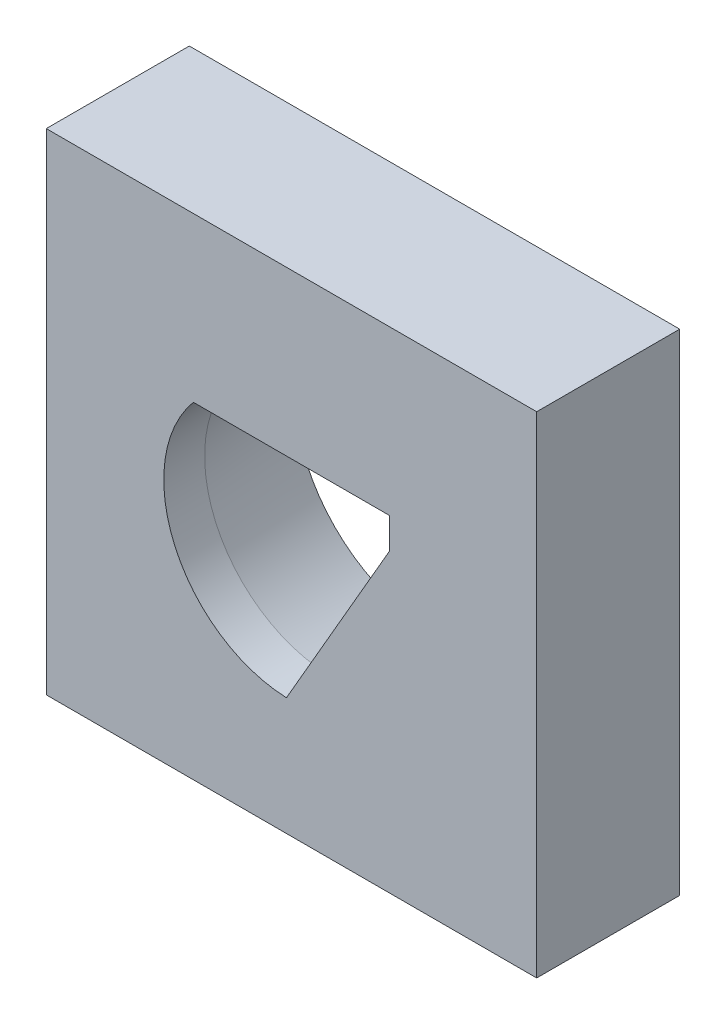
ISO-10303-21;
HEADER;
FILE_DESCRIPTION(('STEP AP214'),'2;1');
FILE_NAME('part.step','',(''),(''),'','','');
FILE_SCHEMA(('AUTOMOTIVE_DESIGN { 1 0 10303 214 1 1 1 1 }'));
ENDSEC;
DATA;
#1=APPLICATION_CONTEXT('core data for automotive mechanical design processes');
#2=APPLICATION_PROTOCOL_DEFINITION('international standard','automotive_design',2000,#1);
#3=PRODUCT_CONTEXT('',#1,'mechanical');
#4=PRODUCT('Part','Part','',(#3));
#5=PRODUCT_RELATED_PRODUCT_CATEGORY('part','',(#4));
#6=PRODUCT_DEFINITION_FORMATION('','',#4);
#7=PRODUCT_DEFINITION_CONTEXT('part definition',#1,'design');
#8=PRODUCT_DEFINITION('design','',#6,#7);
#9=PRODUCT_DEFINITION_SHAPE('','',#8);
#10=(LENGTH_UNIT() NAMED_UNIT(*) SI_UNIT(.MILLI.,.METRE.));
#11=(NAMED_UNIT(*) PLANE_ANGLE_UNIT() SI_UNIT($,.RADIAN.));
#12=(NAMED_UNIT(*) SI_UNIT($,.STERADIAN.) SOLID_ANGLE_UNIT());
#13=UNCERTAINTY_MEASURE_WITH_UNIT(LENGTH_MEASURE(1.E-05),#10,'distance_accuracy_value','');
#14=(GEOMETRIC_REPRESENTATION_CONTEXT(3) GLOBAL_UNCERTAINTY_ASSIGNED_CONTEXT((#13)) GLOBAL_UNIT_ASSIGNED_CONTEXT((#10,
#11,#12)) REPRESENTATION_CONTEXT('',''));
#15=CARTESIAN_POINT('',(0.,0.,0.));
#16=DIRECTION('',(0.,0.,1.));
#17=DIRECTION('',(1.,0.,0.));
#18=AXIS2_PLACEMENT_3D('',#15,#16,#17);
#19=CARTESIAN_POINT('',(0.,0.,-5.));
#20=DIRECTION('',(0.,0.,1.));
#21=DIRECTION('',(1.,0.,0.));
#22=AXIS2_PLACEMENT_3D('',#19,#20,#21);
#23=PLANE('',#22);
#24=DIRECTION('',(0.,1.,0.));
#25=VECTOR('',#24,1.);
#26=CARTESIAN_POINT('',(24.,24.,-5.));
#27=LINE('',#26,#25);
#28=CARTESIAN_POINT('',(24.,-24.,-5.));
#29=VERTEX_POINT('',#28);
#30=CARTESIAN_POINT('',(24.,24.,-5.));
#31=VERTEX_POINT('',#30);
#32=EDGE_CURVE('E175',#29,#31,#27,.T.);
#33=ORIENTED_EDGE('',*,*,#32,.F.);
#34=DIRECTION('',(1.,0.,0.));
#35=VECTOR('',#34,1.);
#36=CARTESIAN_POINT('',(-24.,-24.,-5.));
#37=LINE('',#36,#35);
#38=CARTESIAN_POINT('',(-24.,-24.,-5.));
#39=VERTEX_POINT('',#38);
#40=EDGE_CURVE('E231',#39,#29,#37,.T.);
#41=ORIENTED_EDGE('',*,*,#40,.F.);
#42=DIRECTION('',(0.,-1.,0.));
#43=VECTOR('',#42,1.);
#44=CARTESIAN_POINT('',(-24.,24.,-5.));
#45=LINE('',#44,#43);
#46=CARTESIAN_POINT('',(-24.,24.,-5.));
#47=VERTEX_POINT('',#46);
#48=EDGE_CURVE('E222',#47,#39,#45,.T.);
#49=ORIENTED_EDGE('',*,*,#48,.F.);
#50=DIRECTION('',(-1.,0.,0.));
#51=VECTOR('',#50,1.);
#52=CARTESIAN_POINT('',(-24.,24.,-5.));
#53=LINE('',#52,#51);
#54=EDGE_CURVE('E215',#31,#47,#53,.T.);
#55=ORIENTED_EDGE('',*,*,#54,.F.);
#56=EDGE_LOOP('',(#33,#41,#49,#55));
#57=FACE_BOUND('',#56,.T.);
#58=CARTESIAN_POINT('',(0.,0.,-5.));
#59=DIRECTION('',(0.,0.,1.));
#60=DIRECTION('',(1.,0.,0.));
#61=AXIS2_PLACEMENT_3D('',#58,#59,#60);
#62=CIRCLE('',#61,13.7278456090291);
#63=CARTESIAN_POINT('',(0.210888914936279,-13.7262256622458,-5.));
#64=VERTEX_POINT('',#63);
#65=CARTESIAN_POINT('',(-10.1636907903222,9.22784560902811,-5.));
#66=VERTEX_POINT('',#65);
#67=EDGE_CURVE('E167',#64,#66,#62,.F.);
#68=ORIENTED_EDGE('',*,*,#67,.F.);
#69=DIRECTION('',(0.500000000000001,0.866025403784438,0.));
#70=VECTOR('',#69,1.);
#71=CARTESIAN_POINT('',(6.10179674699358,-3.52287399441714,-5.));
#72=LINE('',#71,#70);
#73=CARTESIAN_POINT('',(10.8325319651757,4.67099976062962,-5.));
#74=VERTEX_POINT('',#73);
#75=EDGE_CURVE('E261',#74,#64,#72,.F.);
#76=ORIENTED_EDGE('',*,*,#75,.F.);
#77=DIRECTION('',(0.,1.,0.));
#78=VECTOR('',#77,1.);
#79=CARTESIAN_POINT('',(10.8325319651757,0.,-5.));
#80=LINE('',#79,#78);
#81=CARTESIAN_POINT('',(10.8325319651757,9.22784560902811,-5.));
#82=VERTEX_POINT('',#81);
#83=EDGE_CURVE('E263',#82,#74,#80,.F.);
#84=ORIENTED_EDGE('',*,*,#83,.F.);
#85=DIRECTION('',(-1.,0.,0.));
#86=VECTOR('',#85,1.);
#87=CARTESIAN_POINT('',(0.,9.22784560902811,-5.));
#88=LINE('',#87,#86);
#89=EDGE_CURVE('E265',#66,#82,#88,.F.);
#90=ORIENTED_EDGE('',*,*,#89,.F.);
#91=EDGE_LOOP('',(#68,#76,#84,#90));
#92=FACE_BOUND('',#91,.T.);
#93=ADVANCED_FACE('F50',(#57,#92),#23,.F.);
#94=CARTESIAN_POINT('',(24.,24.,5.));
#95=DIRECTION('',(-1.,0.,0.));
#96=DIRECTION('',(0.,-1.,0.));
#97=AXIS2_PLACEMENT_3D('',#94,#95,#96);
#98=PLANE('',#97);
#99=ORIENTED_EDGE('',*,*,#32,.T.);
#100=DIRECTION('',(0.,0.,-1.));
#101=VECTOR('',#100,1.);
#102=CARTESIAN_POINT('',(24.,24.,5.));
#103=LINE('',#102,#101);
#104=CARTESIAN_POINT('',(24.,24.,9.));
#105=VERTEX_POINT('',#104);
#106=EDGE_CURVE('E13',#105,#31,#103,.T.);
#107=ORIENTED_EDGE('',*,*,#106,.F.);
#108=DIRECTION('',(0.,1.,0.));
#109=VECTOR('',#108,1.);
#110=CARTESIAN_POINT('',(24.,0.,9.));
#111=LINE('',#110,#109);
#112=CARTESIAN_POINT('',(24.,-24.,9.));
#113=VERTEX_POINT('',#112);
#114=EDGE_CURVE('E247',#113,#105,#111,.T.);
#115=ORIENTED_EDGE('',*,*,#114,.F.);
#116=DIRECTION('',(0.,0.,-1.));
#117=VECTOR('',#116,1.);
#118=CARTESIAN_POINT('',(24.,-24.,5.));
#119=LINE('',#118,#117);
#120=EDGE_CURVE('E233',#113,#29,#119,.T.);
#121=ORIENTED_EDGE('',*,*,#120,.T.);
#122=EDGE_LOOP('',(#99,#107,#115,#121));
#123=FACE_BOUND('',#122,.T.);
#124=ADVANCED_FACE('F52',(#123),#98,.F.);
#125=CARTESIAN_POINT('',(-24.,24.,5.));
#126=DIRECTION('',(0.,-1.,0.));
#127=DIRECTION('',(0.,0.,-1.));
#128=AXIS2_PLACEMENT_3D('',#125,#126,#127);
#129=PLANE('',#128);
#130=ORIENTED_EDGE('',*,*,#54,.T.);
#131=DIRECTION('',(0.,0.,-1.));
#132=VECTOR('',#131,1.);
#133=CARTESIAN_POINT('',(-24.,24.,5.));
#134=LINE('',#133,#132);
#135=CARTESIAN_POINT('',(-24.,24.,9.));
#136=VERTEX_POINT('',#135);
#137=EDGE_CURVE('E58',#136,#47,#134,.T.);
#138=ORIENTED_EDGE('',*,*,#137,.F.);
#139=DIRECTION('',(-1.,0.,0.));
#140=VECTOR('',#139,1.);
#141=CARTESIAN_POINT('',(0.,24.,9.));
#142=LINE('',#141,#140);
#143=EDGE_CURVE('E243',#105,#136,#142,.T.);
#144=ORIENTED_EDGE('',*,*,#143,.F.);
#145=ORIENTED_EDGE('',*,*,#106,.T.);
#146=EDGE_LOOP('',(#130,#138,#144,#145));
#147=FACE_BOUND('',#146,.T.);
#148=ADVANCED_FACE('F207',(#147),#129,.F.);
#149=CARTESIAN_POINT('',(-24.,24.,5.));
#150=DIRECTION('',(1.,0.,0.));
#151=DIRECTION('',(0.,1.,0.));
#152=AXIS2_PLACEMENT_3D('',#149,#150,#151);
#153=PLANE('',#152);
#154=ORIENTED_EDGE('',*,*,#48,.T.);
#155=DIRECTION('',(0.,0.,-1.));
#156=VECTOR('',#155,1.);
#157=CARTESIAN_POINT('',(-24.,-24.,5.));
#158=LINE('',#157,#156);
#159=CARTESIAN_POINT('',(-24.,-24.,9.));
#160=VERTEX_POINT('',#159);
#161=EDGE_CURVE('E228',#160,#39,#158,.T.);
#162=ORIENTED_EDGE('',*,*,#161,.F.);
#163=DIRECTION('',(0.,-1.,0.));
#164=VECTOR('',#163,1.);
#165=CARTESIAN_POINT('',(-24.,0.,9.));
#166=LINE('',#165,#164);
#167=EDGE_CURVE('E227',#136,#160,#166,.T.);
#168=ORIENTED_EDGE('',*,*,#167,.F.);
#169=ORIENTED_EDGE('',*,*,#137,.T.);
#170=EDGE_LOOP('',(#154,#162,#168,#169));
#171=FACE_BOUND('',#170,.T.);
#172=ADVANCED_FACE('F204',(#171),#153,.F.);
#173=CARTESIAN_POINT('',(-24.,-24.,5.));
#174=DIRECTION('',(0.,1.,0.));
#175=DIRECTION('',(0.,0.,1.));
#176=AXIS2_PLACEMENT_3D('',#173,#174,#175);
#177=PLANE('',#176);
#178=ORIENTED_EDGE('',*,*,#40,.T.);
#179=ORIENTED_EDGE('',*,*,#120,.F.);
#180=DIRECTION('',(1.,0.,0.));
#181=VECTOR('',#180,1.);
#182=CARTESIAN_POINT('',(0.,-24.,9.));
#183=LINE('',#182,#181);
#184=EDGE_CURVE('E241',#160,#113,#183,.T.);
#185=ORIENTED_EDGE('',*,*,#184,.F.);
#186=ORIENTED_EDGE('',*,*,#161,.T.);
#187=EDGE_LOOP('',(#178,#179,#185,#186));
#188=FACE_BOUND('',#187,.T.);
#189=ADVANCED_FACE('F189',(#188),#177,.F.);
#190=CARTESIAN_POINT('',(0.,0.,5.));
#191=DIRECTION('',(0.,0.,-1.));
#192=DIRECTION('',(1.,0.,0.));
#193=AXIS2_PLACEMENT_3D('',#190,#191,#192);
#194=CONICAL_SURFACE('',#193,12.5,0.122173047639603);
#195=CARTESIAN_POINT('',(0.,0.,5.));
#196=DIRECTION('',(0.,0.,1.));
#197=DIRECTION('',(1.,0.,0.));
#198=AXIS2_PLACEMENT_3D('',#195,#196,#197);
#199=CIRCLE('',#198,12.5);
#200=CARTESIAN_POINT('',(-0.493320879267116,-12.4902615869356,5.));
#201=VERTEX_POINT('',#200);
#202=CARTESIAN_POINT('',(-9.60468635615006,7.99999999999906,5.));
#203=VERTEX_POINT('',#202);
#204=EDGE_CURVE('E65',#201,#203,#199,.F.);
#205=ORIENTED_EDGE('',*,*,#204,.F.);
#206=CARTESIAN_POINT('',(0.210888914936279,-13.7262256622458,-5.));
#207=CARTESIAN_POINT('',(0.151283619852581,-13.6247927900543,-4.16653905763273));
#208=CARTESIAN_POINT('',(0.091894352196671,-13.5229929108487,-3.33310728614231));
#209=CARTESIAN_POINT('',(-0.0264310062684985,-13.318623754597,-1.66630697376059));
#210=CARTESIAN_POINT('',(-0.085367097641033,-13.2160544785075,-0.832938432791976));
#211=CARTESIAN_POINT('',(-0.202765138392607,-13.0101108776735,0.833732723235585));
#212=CARTESIAN_POINT('',(-0.26122708770264,-12.9067365528118,1.66703533828491));
#213=CARTESIAN_POINT('',(-0.37765323463828,-12.6991428257881,3.33357112192215));
#214=CARTESIAN_POINT('',(-0.435617431644961,-12.5949234225755,4.16680429042242));
#215=CARTESIAN_POINT('',(-0.493320879267227,-12.4902615869358,5.00000000000002));
#216=B_SPLINE_CURVE_WITH_KNOTS('',3,(#206,#207,#208,#209,#210,#211,#212,#213,#214,#215),
.UNSPECIFIED.,.F.,.F.,(4,2,2,2,4),(0.,2.52517065291956,5.05033816667182,7.57550604792841,
10.100677068632),.UNSPECIFIED.);
#217=EDGE_CURVE('E177',#64,#201,#216,.T.);
#218=ORIENTED_EDGE('',*,*,#217,.F.);
#219=ORIENTED_EDGE('',*,*,#67,.T.);
#220=CARTESIAN_POINT('',(-10.1636907903222,9.22784560902811,-5.));
#221=CARTESIAN_POINT('',(-10.1183840525367,9.12551655770584,-4.16659675638546));
#222=CARTESIAN_POINT('',(-10.0727758259363,9.02318948649576,-3.33320963949051));
#223=CARTESIAN_POINT('',(-9.98093015534878,8.81853960132243,-1.66647007819376));
#224=CARTESIAN_POINT('',(-9.93469271174647,8.71621678735663,-0.833117633771086));
#225=CARTESIAN_POINT('',(-9.84156230877992,8.51157558135426,0.833551241350794));
#226=CARTESIAN_POINT('',(-9.79466934936967,8.40925718931799,1.66686767204747));
#227=CARTESIAN_POINT('',(-9.70019869567982,8.20462503794464,3.33346280313381));
#228=CARTESIAN_POINT('',(-9.65262100098146,8.10231127861042,4.16674150350009));
#229=CARTESIAN_POINT('',(-9.60468635615006,7.99999999999906,5.));
#230=B_SPLINE_CURVE_WITH_KNOTS('',3,(#220,#221,#222,#223,#224,#225,#226,#227,#228,#229),
.UNSPECIFIED.,.F.,.F.,(4,2,2,2,4),(0.,2.52265019105946,5.04529883938996,7.56794766475586,
10.0905980329576),.UNSPECIFIED.);
#231=EDGE_CURVE('E168',#66,#203,#230,.T.);
#232=ORIENTED_EDGE('',*,*,#231,.T.);
#233=EDGE_LOOP('',(#205,#218,#219,#232));
#234=FACE_BOUND('',#233,.T.);
#235=ADVANCED_FACE('F186',(#234),#194,.F.);
#236=CARTESIAN_POINT('',(0.,7.99999999999906,5.));
#237=DIRECTION('',(0.,0.992546151641322,0.121869343405148));
#238=DIRECTION('',(0.,-0.121869343405148,0.992546151641322));
#239=AXIS2_PLACEMENT_3D('',#236,#237,#238);
#240=PLANE('',#239);
#241=DIRECTION('',(1.,0.,0.));
#242=VECTOR('',#241,1.);
#243=CARTESIAN_POINT('',(0.,7.99999999999906,5.));
#244=LINE('',#243,#242);
#245=CARTESIAN_POINT('',(9.60468635614661,7.99999999999906,5.));
#246=VERTEX_POINT('',#245);
#247=EDGE_CURVE('E164',#203,#246,#244,.T.);
#248=ORIENTED_EDGE('',*,*,#247,.F.);
#249=ORIENTED_EDGE('',*,*,#231,.F.);
#250=ORIENTED_EDGE('',*,*,#89,.T.);
#251=DIRECTION('',(-0.120974291151355,-0.120974291151355,0.985256536015293));
#252=VECTOR('',#251,1.);
#253=CARTESIAN_POINT('',(9.48760812319004,7.88292176704249,5.9535256883734));
#254=LINE('',#253,#252);
#255=EDGE_CURVE('E176',#82,#246,#254,.T.);
#256=ORIENTED_EDGE('',*,*,#255,.T.);
#257=EDGE_LOOP('',(#248,#249,#250,#256));
#258=FACE_BOUND('',#257,.T.);
#259=ADVANCED_FACE('F183',(#258),#240,.F.);
#260=CARTESIAN_POINT('',(9.60468635614661,0.,5.));
#261=DIRECTION('',(0.992546151641322,0.,0.121869343405148));
#262=DIRECTION('',(0.121869343405148,0.,-0.992546151641322));
#263=AXIS2_PLACEMENT_3D('',#260,#261,#262);
#264=PLANE('',#263);
#265=DIRECTION('',(0.,-1.,0.));
#266=VECTOR('',#265,1.);
#267=CARTESIAN_POINT('',(9.60468635614661,0.,5.));
#268=LINE('',#267,#266);
#269=CARTESIAN_POINT('',(9.60468635614661,4.99999999999906,5.));
#270=VERTEX_POINT('',#269);
#271=EDGE_CURVE('E154',#246,#270,#268,.T.);
#272=ORIENTED_EDGE('',*,*,#271,.F.);
#273=ORIENTED_EDGE('',*,*,#255,.F.);
#274=ORIENTED_EDGE('',*,*,#83,.T.);
#275=DIRECTION('',(-0.121804418523731,0.0326373955779761,0.992017380915265));
#276=VECTOR('',#275,1.);
#277=CARTESIAN_POINT('',(9.56838132599407,5.00972790350962,5.29568074264035));
#278=LINE('',#277,#276);
#279=EDGE_CURVE('E73',#74,#270,#278,.T.);
#280=ORIENTED_EDGE('',*,*,#279,.T.);
#281=EDGE_LOOP('',(#272,#273,#274,#280));
#282=FACE_BOUND('',#281,.T.);
#283=ADVANCED_FACE('F195',(#282),#264,.F.);
#284=CARTESIAN_POINT('',(5.03845125764926,-2.90895118990261,5.));
#285=DIRECTION('',(0.859570181749866,-0.496273075820662,0.121869343405148));
#286=DIRECTION('',(0.500000000000001,0.866025403784438,0.));
#287=AXIS2_PLACEMENT_3D('',#284,#285,#286);
#288=PLANE('',#287);
#289=DIRECTION('',(-0.500000000000001,-0.866025403784438,0.));
#290=VECTOR('',#289,1.);
#291=CARTESIAN_POINT('',(5.03845125764926,-2.90895118990261,5.));
#292=LINE('',#291,#290);
#293=EDGE_CURVE('E156',#270,#201,#292,.T.);
#294=ORIENTED_EDGE('',*,*,#293,.F.);
#295=ORIENTED_EDGE('',*,*,#279,.F.);
#296=ORIENTED_EDGE('',*,*,#75,.T.);
#297=ORIENTED_EDGE('',*,*,#217,.T.);
#298=EDGE_LOOP('',(#294,#295,#296,#297));
#299=FACE_BOUND('',#298,.T.);
#300=ADVANCED_FACE('F190',(#299),#288,.F.);
#301=CARTESIAN_POINT('',(9.60468635614661,0.,9.));
#302=DIRECTION('',(1.,0.,0.));
#303=DIRECTION('',(0.,0.,-1.));
#304=AXIS2_PLACEMENT_3D('',#301,#302,#303);
#305=PLANE('',#304);
#306=ORIENTED_EDGE('',*,*,#271,.T.);
#307=DIRECTION('',(0.,0.,-1.));
#308=VECTOR('',#307,1.);
#309=CARTESIAN_POINT('',(9.60468635614661,4.99999999999906,9.));
#310=LINE('',#309,#308);
#311=CARTESIAN_POINT('',(9.60468635614661,4.99999999999906,9.));
#312=VERTEX_POINT('',#311);
#313=EDGE_CURVE('E134',#312,#270,#310,.T.);
#314=ORIENTED_EDGE('',*,*,#313,.F.);
#315=DIRECTION('',(0.,-1.,0.));
#316=VECTOR('',#315,1.);
#317=CARTESIAN_POINT('',(9.60468635614661,0.,9.));
#318=LINE('',#317,#316);
#319=CARTESIAN_POINT('',(9.60468635614661,7.99999999999906,9.));
#320=VERTEX_POINT('',#319);
#321=EDGE_CURVE('E141',#320,#312,#318,.T.);
#322=ORIENTED_EDGE('',*,*,#321,.F.);
#323=DIRECTION('',(0.,0.,-1.));
#324=VECTOR('',#323,1.);
#325=CARTESIAN_POINT('',(9.60468635614661,7.99999999999906,9.));
#326=LINE('',#325,#324);
#327=EDGE_CURVE('E244',#320,#246,#326,.T.);
#328=ORIENTED_EDGE('',*,*,#327,.T.);
#329=EDGE_LOOP('',(#306,#314,#322,#328));
#330=FACE_BOUND('',#329,.T.);
#331=ADVANCED_FACE('F152',(#330),#305,.F.);
#332=CARTESIAN_POINT('',(5.03845125764926,-2.90895118990261,9.));
#333=DIRECTION('',(0.866025403784438,-0.500000000000001,0.));
#334=DIRECTION('',(0.500000000000001,0.866025403784438,0.));
#335=AXIS2_PLACEMENT_3D('',#332,#333,#334);
#336=PLANE('',#335);
#337=ORIENTED_EDGE('',*,*,#293,.T.);
#338=DIRECTION('',(0.,0.,-1.));
#339=VECTOR('',#338,1.);
#340=CARTESIAN_POINT('',(-0.493320879267116,-12.4902615869356,9.));
#341=LINE('',#340,#339);
#342=CARTESIAN_POINT('',(-0.493320879267116,-12.4902615869356,9.));
#343=VERTEX_POINT('',#342);
#344=EDGE_CURVE('E137',#343,#201,#341,.T.);
#345=ORIENTED_EDGE('',*,*,#344,.F.);
#346=DIRECTION('',(-0.500000000000001,-0.866025403784438,0.));
#347=VECTOR('',#346,1.);
#348=CARTESIAN_POINT('',(5.03845125764926,-2.90895118990261,9.));
#349=LINE('',#348,#347);
#350=EDGE_CURVE('E129',#312,#343,#349,.T.);
#351=ORIENTED_EDGE('',*,*,#350,.F.);
#352=ORIENTED_EDGE('',*,*,#313,.T.);
#353=EDGE_LOOP('',(#337,#345,#351,#352));
#354=FACE_BOUND('',#353,.T.);
#355=ADVANCED_FACE('F132',(#354),#336,.F.);
#356=CARTESIAN_POINT('',(0.,0.,9.));
#357=DIRECTION('',(0.,0.,-1.));
#358=DIRECTION('',(-1.,0.,0.));
#359=AXIS2_PLACEMENT_3D('',#356,#357,#358);
#360=CYLINDRICAL_SURFACE('',#359,12.5);
#361=ORIENTED_EDGE('',*,*,#204,.T.);
#362=DIRECTION('',(0.,0.,-1.));
#363=VECTOR('',#362,1.);
#364=CARTESIAN_POINT('',(-9.60468635615006,7.99999999999906,9.));
#365=LINE('',#364,#363);
#366=CARTESIAN_POINT('',(-9.60468635615006,7.99999999999906,9.));
#367=VERTEX_POINT('',#366);
#368=EDGE_CURVE('E158',#367,#203,#365,.T.);
#369=ORIENTED_EDGE('',*,*,#368,.F.);
#370=CARTESIAN_POINT('',(0.,0.,9.));
#371=DIRECTION('',(0.,0.,1.));
#372=DIRECTION('',(1.,0.,0.));
#373=AXIS2_PLACEMENT_3D('',#370,#371,#372);
#374=CIRCLE('',#373,12.5);
#375=EDGE_CURVE('E140',#343,#367,#374,.F.);
#376=ORIENTED_EDGE('',*,*,#375,.F.);
#377=ORIENTED_EDGE('',*,*,#344,.T.);
#378=EDGE_LOOP('',(#361,#369,#376,#377));
#379=FACE_BOUND('',#378,.T.);
#380=ADVANCED_FACE('F255',(#379),#360,.F.);
#381=CARTESIAN_POINT('',(0.,7.99999999999906,9.));
#382=DIRECTION('',(0.,1.,0.));
#383=DIRECTION('',(-1.,0.,0.));
#384=AXIS2_PLACEMENT_3D('',#381,#382,#383);
#385=PLANE('',#384);
#386=ORIENTED_EDGE('',*,*,#247,.T.);
#387=ORIENTED_EDGE('',*,*,#327,.F.);
#388=DIRECTION('',(1.,0.,0.));
#389=VECTOR('',#388,1.);
#390=CARTESIAN_POINT('',(0.,7.99999999999906,9.));
#391=LINE('',#390,#389);
#392=EDGE_CURVE('E147',#367,#320,#391,.T.);
#393=ORIENTED_EDGE('',*,*,#392,.F.);
#394=ORIENTED_EDGE('',*,*,#368,.T.);
#395=EDGE_LOOP('',(#386,#387,#393,#394));
#396=FACE_BOUND('',#395,.T.);
#397=ADVANCED_FACE('F253',(#396),#385,.F.);
#398=CARTESIAN_POINT('',(0.,0.,9.));
#399=DIRECTION('',(0.,0.,1.));
#400=DIRECTION('',(1.,0.,0.));
#401=AXIS2_PLACEMENT_3D('',#398,#399,#400);
#402=PLANE('',#401);
#403=ORIENTED_EDGE('',*,*,#321,.T.);
#404=ORIENTED_EDGE('',*,*,#350,.T.);
#405=ORIENTED_EDGE('',*,*,#375,.T.);
#406=ORIENTED_EDGE('',*,*,#392,.T.);
#407=EDGE_LOOP('',(#403,#404,#405,#406));
#408=FACE_BOUND('',#407,.T.);
#409=ORIENTED_EDGE('',*,*,#184,.T.);
#410=ORIENTED_EDGE('',*,*,#114,.T.);
#411=ORIENTED_EDGE('',*,*,#143,.T.);
#412=ORIENTED_EDGE('',*,*,#167,.T.);
#413=EDGE_LOOP('',(#409,#410,#411,#412));
#414=FACE_BOUND('',#413,.T.);
#415=ADVANCED_FACE('F144',(#408,#414),#402,.T.);
#416=CLOSED_SHELL('',(#93,#124,#148,#172,#189,#235,#259,#283,#300,#331,#355,#380,#397,#415));
#417=MANIFOLD_SOLID_BREP('B2',#416);
#418=ADVANCED_BREP_SHAPE_REPRESENTATION('',(#18,#417),#14);
#419=SHAPE_DEFINITION_REPRESENTATION(#9,#418);
ENDSEC;
END-ISO-10303-21;
